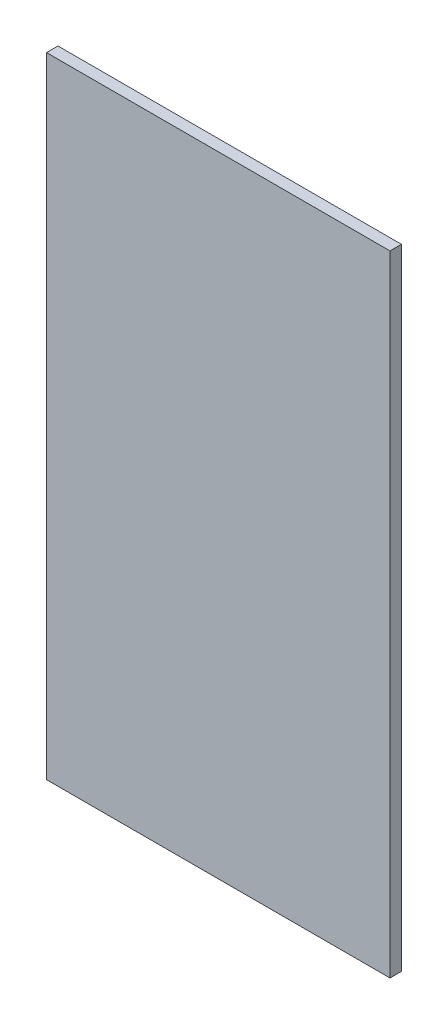
ISO-10303-21;
HEADER;
FILE_DESCRIPTION(('STEP AP214'),'2;1');
FILE_NAME('part.step','',(''),(''),'','','');
FILE_SCHEMA(('AUTOMOTIVE_DESIGN { 1 0 10303 214 1 1 1 1 }'));
ENDSEC;
DATA;
#1=APPLICATION_CONTEXT('core data for automotive mechanical design processes');
#2=APPLICATION_PROTOCOL_DEFINITION('international standard','automotive_design',2000,#1);
#3=PRODUCT_CONTEXT('',#1,'mechanical');
#4=PRODUCT('Part','Part','',(#3));
#5=PRODUCT_RELATED_PRODUCT_CATEGORY('part','',(#4));
#6=PRODUCT_DEFINITION_FORMATION('','',#4);
#7=PRODUCT_DEFINITION_CONTEXT('part definition',#1,'design');
#8=PRODUCT_DEFINITION('design','',#6,#7);
#9=PRODUCT_DEFINITION_SHAPE('','',#8);
#10=(LENGTH_UNIT() NAMED_UNIT(*) SI_UNIT(.MILLI.,.METRE.));
#11=(NAMED_UNIT(*) PLANE_ANGLE_UNIT() SI_UNIT($,.RADIAN.));
#12=(NAMED_UNIT(*) SI_UNIT($,.STERADIAN.) SOLID_ANGLE_UNIT());
#13=UNCERTAINTY_MEASURE_WITH_UNIT(LENGTH_MEASURE(1.E-05),#10,'distance_accuracy_value','');
#14=(GEOMETRIC_REPRESENTATION_CONTEXT(3) GLOBAL_UNCERTAINTY_ASSIGNED_CONTEXT((#13)) GLOBAL_UNIT_ASSIGNED_CONTEXT((#10,
#11,#12)) REPRESENTATION_CONTEXT('',''));
#15=CARTESIAN_POINT('',(0.,0.,0.));
#16=DIRECTION('',(0.,0.,1.));
#17=DIRECTION('',(1.,0.,0.));
#18=AXIS2_PLACEMENT_3D('',#15,#16,#17);
#19=CARTESIAN_POINT('',(0.,0.,0.01));
#20=DIRECTION('',(0.,0.,1.));
#21=DIRECTION('',(1.,0.,0.));
#22=AXIS2_PLACEMENT_3D('',#19,#20,#21);
#23=PLANE('',#22);
#24=DIRECTION('',(0.,1.,0.));
#25=VECTOR('',#24,1.);
#26=CARTESIAN_POINT('',(0.,0.,0.01));
#27=LINE('',#26,#25);
#28=CARTESIAN_POINT('',(0.,0.,0.01));
#29=VERTEX_POINT('',#28);
#30=CARTESIAN_POINT('',(0.,0.55,0.01));
#31=VERTEX_POINT('',#30);
#32=EDGE_CURVE('E96',#29,#31,#27,.T.);
#33=ORIENTED_EDGE('',*,*,#32,.F.);
#34=DIRECTION('',(1.,0.,0.));
#35=VECTOR('',#34,1.);
#36=CARTESIAN_POINT('',(0.,0.,0.01));
#37=LINE('',#36,#35);
#38=CARTESIAN_POINT('',(0.3,0.,0.01));
#39=VERTEX_POINT('',#38);
#40=EDGE_CURVE('E67',#29,#39,#37,.T.);
#41=ORIENTED_EDGE('',*,*,#40,.T.);
#42=DIRECTION('',(0.,1.,0.));
#43=VECTOR('',#42,1.);
#44=CARTESIAN_POINT('',(0.3,0.,0.01));
#45=LINE('',#44,#43);
#46=CARTESIAN_POINT('',(0.3,0.55,0.01));
#47=VERTEX_POINT('',#46);
#48=EDGE_CURVE('E84',#39,#47,#45,.T.);
#49=ORIENTED_EDGE('',*,*,#48,.T.);
#50=DIRECTION('',(1.,0.,0.));
#51=VECTOR('',#50,1.);
#52=CARTESIAN_POINT('',(0.,0.55,0.01));
#53=LINE('',#52,#51);
#54=EDGE_CURVE('E11',#31,#47,#53,.T.);
#55=ORIENTED_EDGE('',*,*,#54,.F.);
#56=EDGE_LOOP('',(#33,#41,#49,#55));
#57=FACE_BOUND('',#56,.T.);
#58=ADVANCED_FACE('F16',(#57),#23,.T.);
#59=CARTESIAN_POINT('',(0.,0.,0.));
#60=DIRECTION('',(0.,0.,1.));
#61=DIRECTION('',(1.,0.,0.));
#62=AXIS2_PLACEMENT_3D('',#59,#60,#61);
#63=PLANE('',#62);
#64=DIRECTION('',(0.,1.,0.));
#65=VECTOR('',#64,1.);
#66=CARTESIAN_POINT('',(0.,0.,0.));
#67=LINE('',#66,#65);
#68=CARTESIAN_POINT('',(0.,0.,0.));
#69=VERTEX_POINT('',#68);
#70=CARTESIAN_POINT('',(0.,0.55,0.));
#71=VERTEX_POINT('',#70);
#72=EDGE_CURVE('E19',#69,#71,#67,.T.);
#73=ORIENTED_EDGE('',*,*,#72,.T.);
#74=DIRECTION('',(1.,0.,0.));
#75=VECTOR('',#74,1.);
#76=CARTESIAN_POINT('',(0.,0.55,0.));
#77=LINE('',#76,#75);
#78=CARTESIAN_POINT('',(0.3,0.55,0.));
#79=VERTEX_POINT('',#78);
#80=EDGE_CURVE('E26',#71,#79,#77,.T.);
#81=ORIENTED_EDGE('',*,*,#80,.T.);
#82=DIRECTION('',(0.,1.,0.));
#83=VECTOR('',#82,1.);
#84=CARTESIAN_POINT('',(0.3,0.,0.));
#85=LINE('',#84,#83);
#86=CARTESIAN_POINT('',(0.3,0.,0.));
#87=VERTEX_POINT('',#86);
#88=EDGE_CURVE('E81',#87,#79,#85,.T.);
#89=ORIENTED_EDGE('',*,*,#88,.F.);
#90=DIRECTION('',(1.,0.,0.));
#91=VECTOR('',#90,1.);
#92=CARTESIAN_POINT('',(0.,0.,0.));
#93=LINE('',#92,#91);
#94=EDGE_CURVE('E58',#69,#87,#93,.T.);
#95=ORIENTED_EDGE('',*,*,#94,.F.);
#96=EDGE_LOOP('',(#73,#81,#89,#95));
#97=FACE_BOUND('',#96,.T.);
#98=ADVANCED_FACE('F78',(#97),#63,.F.);
#99=CARTESIAN_POINT('',(0.,0.55,0.));
#100=DIRECTION('',(0.,1.,0.));
#101=DIRECTION('',(1.,0.,0.));
#102=AXIS2_PLACEMENT_3D('',#99,#100,#101);
#103=PLANE('',#102);
#104=ORIENTED_EDGE('',*,*,#80,.F.);
#105=DIRECTION('',(0.,0.,1.));
#106=VECTOR('',#105,1.);
#107=CARTESIAN_POINT('',(0.,0.55,0.));
#108=LINE('',#107,#106);
#109=EDGE_CURVE('E91',#71,#31,#108,.T.);
#110=ORIENTED_EDGE('',*,*,#109,.T.);
#111=ORIENTED_EDGE('',*,*,#54,.T.);
#112=DIRECTION('',(0.,0.,1.));
#113=VECTOR('',#112,1.);
#114=CARTESIAN_POINT('',(0.3,0.55,0.));
#115=LINE('',#114,#113);
#116=EDGE_CURVE('E106',#79,#47,#115,.T.);
#117=ORIENTED_EDGE('',*,*,#116,.F.);
#118=EDGE_LOOP('',(#104,#110,#111,#117));
#119=FACE_BOUND('',#118,.T.);
#120=ADVANCED_FACE('F182',(#119),#103,.T.);
#121=CARTESIAN_POINT('',(0.,0.,0.));
#122=DIRECTION('',(0.,1.,0.));
#123=DIRECTION('',(1.,0.,0.));
#124=AXIS2_PLACEMENT_3D('',#121,#122,#123);
#125=PLANE('',#124);
#126=ORIENTED_EDGE('',*,*,#94,.T.);
#127=DIRECTION('',(0.,0.,1.));
#128=VECTOR('',#127,1.);
#129=CARTESIAN_POINT('',(0.3,0.,0.));
#130=LINE('',#129,#128);
#131=EDGE_CURVE('E93',#87,#39,#130,.T.);
#132=ORIENTED_EDGE('',*,*,#131,.T.);
#133=ORIENTED_EDGE('',*,*,#40,.F.);
#134=DIRECTION('',(0.,0.,1.));
#135=VECTOR('',#134,1.);
#136=CARTESIAN_POINT('',(0.,0.,0.));
#137=LINE('',#136,#135);
#138=EDGE_CURVE('E90',#69,#29,#137,.T.);
#139=ORIENTED_EDGE('',*,*,#138,.F.);
#140=EDGE_LOOP('',(#126,#132,#133,#139));
#141=FACE_BOUND('',#140,.T.);
#142=ADVANCED_FACE('F94',(#141),#125,.F.);
#143=CARTESIAN_POINT('',(0.3,0.,0.));
#144=DIRECTION('',(1.,0.,0.));
#145=DIRECTION('',(0.,1.,0.));
#146=AXIS2_PLACEMENT_3D('',#143,#144,#145);
#147=PLANE('',#146);
#148=ORIENTED_EDGE('',*,*,#131,.F.);
#149=ORIENTED_EDGE('',*,*,#88,.T.);
#150=ORIENTED_EDGE('',*,*,#116,.T.);
#151=ORIENTED_EDGE('',*,*,#48,.F.);
#152=EDGE_LOOP('',(#148,#149,#150,#151));
#153=FACE_BOUND('',#152,.T.);
#154=ADVANCED_FACE('F161',(#153),#147,.T.);
#155=CARTESIAN_POINT('',(0.,0.,0.));
#156=DIRECTION('',(1.,0.,0.));
#157=DIRECTION('',(0.,1.,0.));
#158=AXIS2_PLACEMENT_3D('',#155,#156,#157);
#159=PLANE('',#158);
#160=ORIENTED_EDGE('',*,*,#138,.T.);
#161=ORIENTED_EDGE('',*,*,#32,.T.);
#162=ORIENTED_EDGE('',*,*,#109,.F.);
#163=ORIENTED_EDGE('',*,*,#72,.F.);
#164=EDGE_LOOP('',(#160,#161,#162,#163));
#165=FACE_BOUND('',#164,.T.);
#166=ADVANCED_FACE('F88',(#165),#159,.F.);
#167=CLOSED_SHELL('',(#58,#98,#120,#142,#154,#166));
#168=MANIFOLD_SOLID_BREP('B1',#167);
#169=ADVANCED_BREP_SHAPE_REPRESENTATION('',(#18,#168),#14);
#170=SHAPE_DEFINITION_REPRESENTATION(#9,#169);
ENDSEC;
END-ISO-10303-21;
